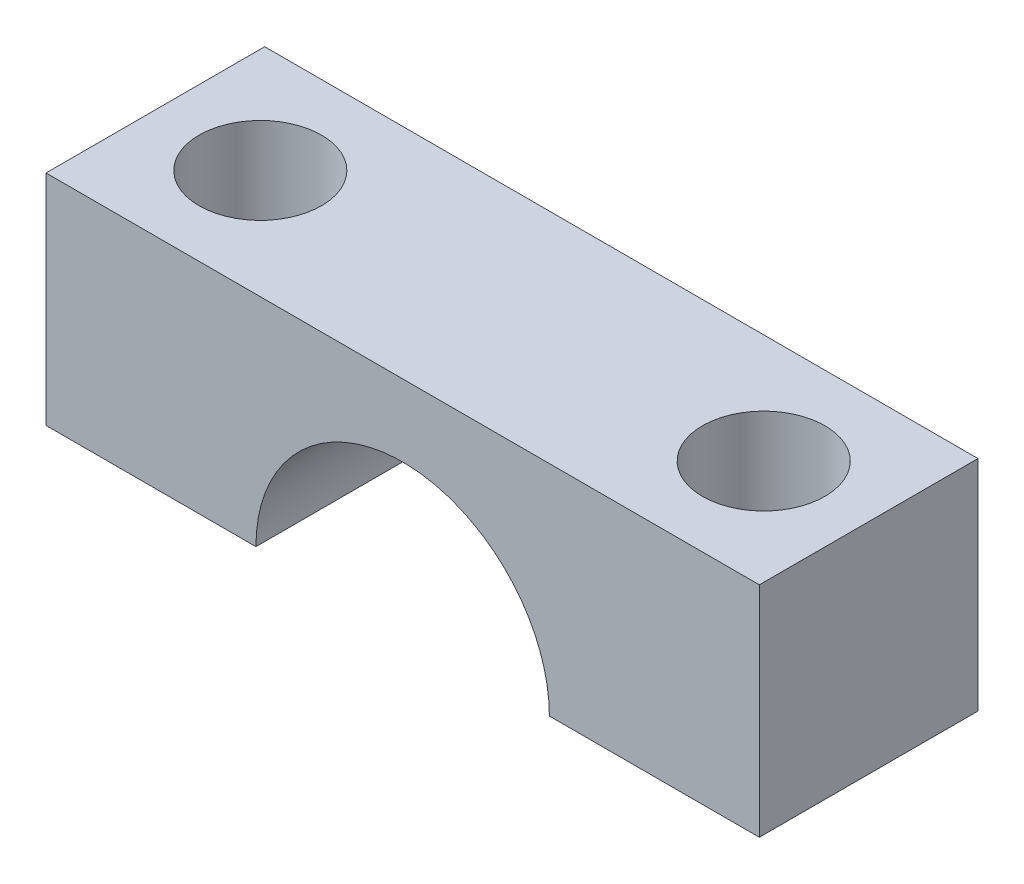
ISO-10303-21;
HEADER;
FILE_DESCRIPTION(('STEP AP214'),'2;1');
FILE_NAME('part.step','',(''),(''),'','','');
FILE_SCHEMA(('AUTOMOTIVE_DESIGN { 1 0 10303 214 1 1 1 1 }'));
ENDSEC;
DATA;
#1=APPLICATION_CONTEXT('core data for automotive mechanical design processes');
#2=APPLICATION_PROTOCOL_DEFINITION('international standard','automotive_design',2000,#1);
#3=PRODUCT_CONTEXT('',#1,'mechanical');
#4=PRODUCT('Part','Part','',(#3));
#5=PRODUCT_RELATED_PRODUCT_CATEGORY('part','',(#4));
#6=PRODUCT_DEFINITION_FORMATION('','',#4);
#7=PRODUCT_DEFINITION_CONTEXT('part definition',#1,'design');
#8=PRODUCT_DEFINITION('design','',#6,#7);
#9=PRODUCT_DEFINITION_SHAPE('','',#8);
#10=(LENGTH_UNIT() NAMED_UNIT(*) SI_UNIT(.MILLI.,.METRE.));
#11=(NAMED_UNIT(*) PLANE_ANGLE_UNIT() SI_UNIT($,.RADIAN.));
#12=(NAMED_UNIT(*) SI_UNIT($,.STERADIAN.) SOLID_ANGLE_UNIT());
#13=UNCERTAINTY_MEASURE_WITH_UNIT(LENGTH_MEASURE(1.E-05),#10,'distance_accuracy_value','');
#14=(GEOMETRIC_REPRESENTATION_CONTEXT(3) GLOBAL_UNCERTAINTY_ASSIGNED_CONTEXT((#13)) GLOBAL_UNIT_ASSIGNED_CONTEXT((#10,
#11,#12)) REPRESENTATION_CONTEXT('',''));
#15=CARTESIAN_POINT('',(0.,0.,0.));
#16=DIRECTION('',(0.,0.,1.));
#17=DIRECTION('',(1.,0.,0.));
#18=AXIS2_PLACEMENT_3D('',#15,#16,#17);
#19=CARTESIAN_POINT('',(-8.155,-2.5,-5.));
#20=DIRECTION('',(0.,-1.,0.));
#21=DIRECTION('',(0.,0.,-1.));
#22=AXIS2_PLACEMENT_3D('',#19,#20,#21);
#23=PLANE('',#22);
#24=CARTESIAN_POINT('',(5.755,-2.5,-2.5));
#25=DIRECTION('',(0.,1.,0.));
#26=DIRECTION('',(0.,0.,1.));
#27=AXIS2_PLACEMENT_3D('',#24,#25,#26);
#28=CIRCLE('',#27,1.4);
#29=CARTESIAN_POINT('',(5.755,-2.5,-1.1));
#30=VERTEX_POINT('',#29);
#31=EDGE_CURVE('E146',#30,#30,#28,.T.);
#32=ORIENTED_EDGE('',*,*,#31,.T.);
#33=EDGE_LOOP('',(#32));
#34=FACE_BOUND('',#33,.T.);
#35=DIRECTION('',(0.,0.,1.));
#36=VECTOR('',#35,1.);
#37=CARTESIAN_POINT('',(3.355,-2.5,-5.));
#38=LINE('',#37,#36);
#39=CARTESIAN_POINT('',(3.355,-2.5,-5.));
#40=VERTEX_POINT('',#39);
#41=CARTESIAN_POINT('',(3.355,-2.5,0.));
#42=VERTEX_POINT('',#41);
#43=EDGE_CURVE('E53',#40,#42,#38,.T.);
#44=ORIENTED_EDGE('',*,*,#43,.F.);
#45=DIRECTION('',(1.,0.,0.));
#46=VECTOR('',#45,1.);
#47=CARTESIAN_POINT('',(-8.155,-2.5,-5.));
#48=LINE('',#47,#46);
#49=CARTESIAN_POINT('',(8.155,-2.5,-5.));
#50=VERTEX_POINT('',#49);
#51=EDGE_CURVE('E85',#40,#50,#48,.T.);
#52=ORIENTED_EDGE('',*,*,#51,.T.);
#53=DIRECTION('',(0.,0.,1.));
#54=VECTOR('',#53,1.);
#55=CARTESIAN_POINT('',(8.155,-2.5,-5.));
#56=LINE('',#55,#54);
#57=CARTESIAN_POINT('',(8.155,-2.5,0.));
#58=VERTEX_POINT('',#57);
#59=EDGE_CURVE('E40',#50,#58,#56,.T.);
#60=ORIENTED_EDGE('',*,*,#59,.T.);
#61=DIRECTION('',(1.,0.,0.));
#62=VECTOR('',#61,1.);
#63=CARTESIAN_POINT('',(-8.155,-2.5,0.));
#64=LINE('',#63,#62);
#65=EDGE_CURVE('E122',#42,#58,#64,.T.);
#66=ORIENTED_EDGE('',*,*,#65,.F.);
#67=EDGE_LOOP('',(#44,#52,#60,#66));
#68=FACE_BOUND('',#67,.T.);
#69=ADVANCED_FACE('F36',(#34,#68),#23,.T.);
#70=CARTESIAN_POINT('',(-5.755,-2.5,-2.5));
#71=DIRECTION('',(0.,1.,0.));
#72=DIRECTION('',(0.,0.,1.));
#73=AXIS2_PLACEMENT_3D('',#70,#71,#72);
#74=CIRCLE('',#73,1.4);
#75=CARTESIAN_POINT('',(-5.755,-2.5,-1.1));
#76=VERTEX_POINT('',#75);
#77=EDGE_CURVE('E145',#76,#76,#74,.T.);
#78=ORIENTED_EDGE('',*,*,#77,.T.);
#79=EDGE_LOOP('',(#78));
#80=FACE_BOUND('',#79,.T.);
#81=DIRECTION('',(0.,0.,1.));
#82=VECTOR('',#81,1.);
#83=CARTESIAN_POINT('',(-3.355,-2.5,-5.));
#84=LINE('',#83,#82);
#85=CARTESIAN_POINT('',(-3.355,-2.5,-5.));
#86=VERTEX_POINT('',#85);
#87=CARTESIAN_POINT('',(-3.355,-2.5,0.));
#88=VERTEX_POINT('',#87);
#89=EDGE_CURVE('E95',#86,#88,#84,.T.);
#90=ORIENTED_EDGE('',*,*,#89,.T.);
#91=CARTESIAN_POINT('',(-8.155,-2.5,0.));
#92=VERTEX_POINT('',#91);
#93=EDGE_CURVE('E119',#92,#88,#64,.T.);
#94=ORIENTED_EDGE('',*,*,#93,.F.);
#95=DIRECTION('',(0.,0.,1.));
#96=VECTOR('',#95,1.);
#97=CARTESIAN_POINT('',(-8.155,-2.5,-5.));
#98=LINE('',#97,#96);
#99=CARTESIAN_POINT('',(-8.155,-2.5,-5.));
#100=VERTEX_POINT('',#99);
#101=EDGE_CURVE('E11',#100,#92,#98,.T.);
#102=ORIENTED_EDGE('',*,*,#101,.F.);
#103=EDGE_CURVE('E105',#100,#86,#48,.T.);
#104=ORIENTED_EDGE('',*,*,#103,.T.);
#105=EDGE_LOOP('',(#90,#94,#102,#104));
#106=FACE_BOUND('',#105,.T.);
#107=ADVANCED_FACE('F38',(#80,#106),#23,.T.);
#108=CARTESIAN_POINT('',(-8.155,-2.5,-5.));
#109=DIRECTION('',(1.,0.,0.));
#110=DIRECTION('',(0.,0.,-1.));
#111=AXIS2_PLACEMENT_3D('',#108,#109,#110);
#112=PLANE('',#111);
#113=DIRECTION('',(0.,1.,0.));
#114=VECTOR('',#113,1.);
#115=CARTESIAN_POINT('',(-8.155,-2.5,0.));
#116=LINE('',#115,#114);
#117=CARTESIAN_POINT('',(-8.155,2.5,0.));
#118=VERTEX_POINT('',#117);
#119=EDGE_CURVE('E113',#92,#118,#116,.T.);
#120=ORIENTED_EDGE('',*,*,#119,.T.);
#121=DIRECTION('',(0.,0.,1.));
#122=VECTOR('',#121,1.);
#123=CARTESIAN_POINT('',(-8.155,2.5,-5.));
#124=LINE('',#123,#122);
#125=CARTESIAN_POINT('',(-8.155,2.5,-5.));
#126=VERTEX_POINT('',#125);
#127=EDGE_CURVE('E45',#126,#118,#124,.T.);
#128=ORIENTED_EDGE('',*,*,#127,.F.);
#129=DIRECTION('',(0.,1.,0.));
#130=VECTOR('',#129,1.);
#131=CARTESIAN_POINT('',(-8.155,-2.5,-5.));
#132=LINE('',#131,#130);
#133=EDGE_CURVE('E117',#100,#126,#132,.T.);
#134=ORIENTED_EDGE('',*,*,#133,.F.);
#135=ORIENTED_EDGE('',*,*,#101,.T.);
#136=EDGE_LOOP('',(#120,#128,#134,#135));
#137=FACE_BOUND('',#136,.T.);
#138=ADVANCED_FACE('F170',(#137),#112,.F.);
#139=CARTESIAN_POINT('',(-8.155,2.5,-5.));
#140=DIRECTION('',(0.,-1.,0.));
#141=DIRECTION('',(0.,0.,-1.));
#142=AXIS2_PLACEMENT_3D('',#139,#140,#141);
#143=PLANE('',#142);
#144=CARTESIAN_POINT('',(-5.755,2.5,-2.5));
#145=DIRECTION('',(0.,1.,0.));
#146=DIRECTION('',(0.,0.,1.));
#147=AXIS2_PLACEMENT_3D('',#144,#145,#146);
#148=CIRCLE('',#147,1.4);
#149=CARTESIAN_POINT('',(-5.755,2.5,-1.1));
#150=VERTEX_POINT('',#149);
#151=EDGE_CURVE('E140',#150,#150,#148,.T.);
#152=ORIENTED_EDGE('',*,*,#151,.F.);
#153=EDGE_LOOP('',(#152));
#154=FACE_BOUND('',#153,.T.);
#155=CARTESIAN_POINT('',(5.755,2.5,-2.5));
#156=DIRECTION('',(0.,1.,0.));
#157=DIRECTION('',(0.,0.,1.));
#158=AXIS2_PLACEMENT_3D('',#155,#156,#157);
#159=CIRCLE('',#158,1.4);
#160=CARTESIAN_POINT('',(5.755,2.5,-1.1));
#161=VERTEX_POINT('',#160);
#162=EDGE_CURVE('E142',#161,#161,#159,.T.);
#163=ORIENTED_EDGE('',*,*,#162,.F.);
#164=EDGE_LOOP('',(#163));
#165=FACE_BOUND('',#164,.T.);
#166=DIRECTION('',(1.,0.,0.));
#167=VECTOR('',#166,1.);
#168=CARTESIAN_POINT('',(-8.155,2.5,0.));
#169=LINE('',#168,#167);
#170=CARTESIAN_POINT('',(8.155,2.5,0.));
#171=VERTEX_POINT('',#170);
#172=EDGE_CURVE('E125',#118,#171,#169,.T.);
#173=ORIENTED_EDGE('',*,*,#172,.T.);
#174=DIRECTION('',(0.,0.,1.));
#175=VECTOR('',#174,1.);
#176=CARTESIAN_POINT('',(8.155,2.5,-5.));
#177=LINE('',#176,#175);
#178=CARTESIAN_POINT('',(8.155,2.5,-5.));
#179=VERTEX_POINT('',#178);
#180=EDGE_CURVE('E130',#179,#171,#177,.T.);
#181=ORIENTED_EDGE('',*,*,#180,.F.);
#182=DIRECTION('',(1.,0.,0.));
#183=VECTOR('',#182,1.);
#184=CARTESIAN_POINT('',(-8.155,2.5,-5.));
#185=LINE('',#184,#183);
#186=EDGE_CURVE('E111',#126,#179,#185,.T.);
#187=ORIENTED_EDGE('',*,*,#186,.F.);
#188=ORIENTED_EDGE('',*,*,#127,.T.);
#189=EDGE_LOOP('',(#173,#181,#187,#188));
#190=FACE_BOUND('',#189,.T.);
#191=ADVANCED_FACE('F176',(#154,#165,#190),#143,.F.);
#192=CARTESIAN_POINT('',(8.155,-2.5,-5.));
#193=DIRECTION('',(1.,0.,0.));
#194=DIRECTION('',(0.,0.,-1.));
#195=AXIS2_PLACEMENT_3D('',#192,#193,#194);
#196=PLANE('',#195);
#197=DIRECTION('',(0.,1.,0.));
#198=VECTOR('',#197,1.);
#199=CARTESIAN_POINT('',(8.155,-2.5,0.));
#200=LINE('',#199,#198);
#201=EDGE_CURVE('E121',#58,#171,#200,.T.);
#202=ORIENTED_EDGE('',*,*,#201,.F.);
#203=ORIENTED_EDGE('',*,*,#59,.F.);
#204=DIRECTION('',(0.,1.,0.));
#205=VECTOR('',#204,1.);
#206=CARTESIAN_POINT('',(8.155,-2.5,-5.));
#207=LINE('',#206,#205);
#208=EDGE_CURVE('E108',#50,#179,#207,.T.);
#209=ORIENTED_EDGE('',*,*,#208,.T.);
#210=ORIENTED_EDGE('',*,*,#180,.T.);
#211=EDGE_LOOP('',(#202,#203,#209,#210));
#212=FACE_BOUND('',#211,.T.);
#213=ADVANCED_FACE('F135',(#212),#196,.T.);
#214=CARTESIAN_POINT('',(0.,0.,-5.));
#215=DIRECTION('',(0.,0.,1.));
#216=DIRECTION('',(1.,0.,0.));
#217=AXIS2_PLACEMENT_3D('',#214,#215,#216);
#218=PLANE('',#217);
#219=ORIENTED_EDGE('',*,*,#51,.F.);
#220=CARTESIAN_POINT('',(0.,-2.5,-5.));
#221=DIRECTION('',(0.,0.,1.));
#222=DIRECTION('',(1.,0.,0.));
#223=AXIS2_PLACEMENT_3D('',#220,#221,#222);
#224=CIRCLE('',#223,3.355);
#225=EDGE_CURVE('E98',#40,#86,#224,.T.);
#226=ORIENTED_EDGE('',*,*,#225,.T.);
#227=ORIENTED_EDGE('',*,*,#103,.F.);
#228=ORIENTED_EDGE('',*,*,#133,.T.);
#229=ORIENTED_EDGE('',*,*,#186,.T.);
#230=ORIENTED_EDGE('',*,*,#208,.F.);
#231=EDGE_LOOP('',(#219,#226,#227,#228,#229,#230));
#232=FACE_BOUND('',#231,.T.);
#233=ADVANCED_FACE('F104',(#232),#218,.F.);
#234=CARTESIAN_POINT('',(0.,0.,0.));
#235=DIRECTION('',(0.,0.,1.));
#236=DIRECTION('',(1.,0.,0.));
#237=AXIS2_PLACEMENT_3D('',#234,#235,#236);
#238=PLANE('',#237);
#239=CARTESIAN_POINT('',(0.,-2.5,0.));
#240=DIRECTION('',(0.,0.,1.));
#241=DIRECTION('',(1.,0.,0.));
#242=AXIS2_PLACEMENT_3D('',#239,#240,#241);
#243=CIRCLE('',#242,3.355);
#244=EDGE_CURVE('E99',#42,#88,#243,.T.);
#245=ORIENTED_EDGE('',*,*,#244,.F.);
#246=ORIENTED_EDGE('',*,*,#65,.T.);
#247=ORIENTED_EDGE('',*,*,#201,.T.);
#248=ORIENTED_EDGE('',*,*,#172,.F.);
#249=ORIENTED_EDGE('',*,*,#119,.F.);
#250=ORIENTED_EDGE('',*,*,#93,.T.);
#251=EDGE_LOOP('',(#245,#246,#247,#248,#249,#250));
#252=FACE_BOUND('',#251,.T.);
#253=ADVANCED_FACE('F138',(#252),#238,.T.);
#254=CARTESIAN_POINT('',(0.,-2.5,-5.));
#255=DIRECTION('',(0.,0.,1.));
#256=DIRECTION('',(1.,0.,0.));
#257=AXIS2_PLACEMENT_3D('',#254,#255,#256);
#258=CYLINDRICAL_SURFACE('',#257,3.355);
#259=ORIENTED_EDGE('',*,*,#244,.T.);
#260=ORIENTED_EDGE('',*,*,#89,.F.);
#261=ORIENTED_EDGE('',*,*,#225,.F.);
#262=ORIENTED_EDGE('',*,*,#43,.T.);
#263=EDGE_LOOP('',(#259,#260,#261,#262));
#264=FACE_BOUND('',#263,.T.);
#265=ADVANCED_FACE('F97',(#264),#258,.F.);
#266=CARTESIAN_POINT('',(5.755,2.5,-2.5));
#267=DIRECTION('',(0.,-1.,0.));
#268=DIRECTION('',(0.,0.,-1.));
#269=AXIS2_PLACEMENT_3D('',#266,#267,#268);
#270=CYLINDRICAL_SURFACE('',#269,1.4);
#271=ORIENTED_EDGE('',*,*,#162,.T.);
#272=EDGE_LOOP('',(#271));
#273=FACE_BOUND('',#272,.T.);
#274=ORIENTED_EDGE('',*,*,#31,.F.);
#275=EDGE_LOOP('',(#274));
#276=FACE_BOUND('',#275,.T.);
#277=ADVANCED_FACE('F157',(#273,#276),#270,.F.);
#278=CARTESIAN_POINT('',(-5.755,2.5,-2.5));
#279=DIRECTION('',(0.,-1.,0.));
#280=DIRECTION('',(0.,0.,-1.));
#281=AXIS2_PLACEMENT_3D('',#278,#279,#280);
#282=CYLINDRICAL_SURFACE('',#281,1.4);
#283=ORIENTED_EDGE('',*,*,#151,.T.);
#284=EDGE_LOOP('',(#283));
#285=FACE_BOUND('',#284,.T.);
#286=ORIENTED_EDGE('',*,*,#77,.F.);
#287=EDGE_LOOP('',(#286));
#288=FACE_BOUND('',#287,.T.);
#289=ADVANCED_FACE('F155',(#285,#288),#282,.F.);
#290=CLOSED_SHELL('',(#69,#107,#138,#191,#213,#233,#253,#265,#277,#289));
#291=MANIFOLD_SOLID_BREP('B2',#290);
#292=ADVANCED_BREP_SHAPE_REPRESENTATION('',(#18,#291),#14);
#293=SHAPE_DEFINITION_REPRESENTATION(#9,#292);
ENDSEC;
END-ISO-10303-21;
